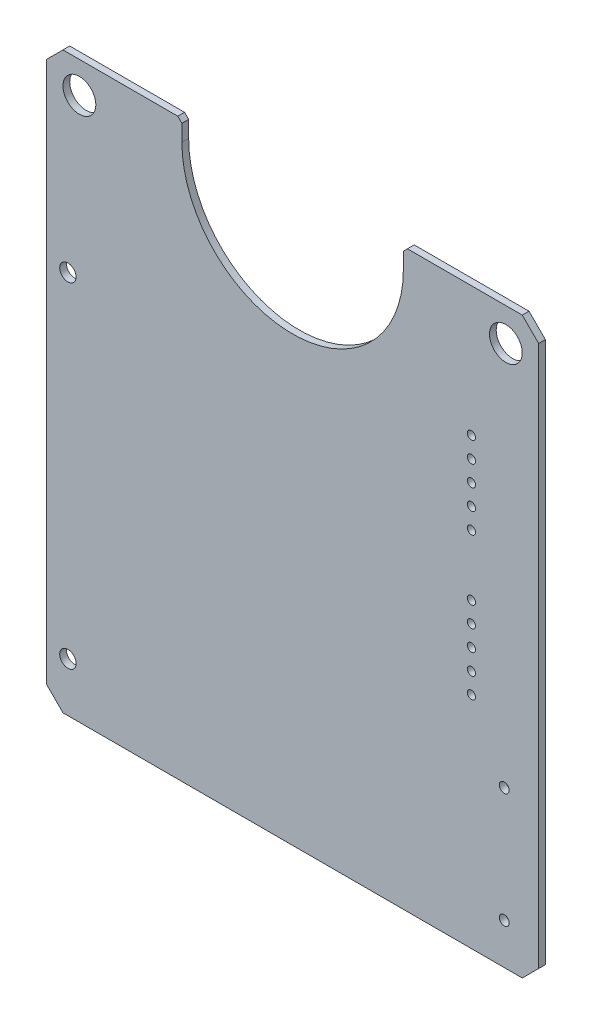
ISO-10303-21;
HEADER;
FILE_DESCRIPTION(('STEP AP214'),'2;1');
FILE_NAME('part.step','',(''),(''),'','','');
FILE_SCHEMA(('AUTOMOTIVE_DESIGN { 1 0 10303 214 1 1 1 1 }'));
ENDSEC;
DATA;
#1=APPLICATION_CONTEXT('core data for automotive mechanical design processes');
#2=APPLICATION_PROTOCOL_DEFINITION('international standard','automotive_design',2000,#1);
#3=PRODUCT_CONTEXT('',#1,'mechanical');
#4=PRODUCT('Part','Part','',(#3));
#5=PRODUCT_RELATED_PRODUCT_CATEGORY('part','',(#4));
#6=PRODUCT_DEFINITION_FORMATION('','',#4);
#7=PRODUCT_DEFINITION_CONTEXT('part definition',#1,'design');
#8=PRODUCT_DEFINITION('design','',#6,#7);
#9=PRODUCT_DEFINITION_SHAPE('','',#8);
#10=(LENGTH_UNIT() NAMED_UNIT(*) SI_UNIT(.MILLI.,.METRE.));
#11=(NAMED_UNIT(*) PLANE_ANGLE_UNIT() SI_UNIT($,.RADIAN.));
#12=(NAMED_UNIT(*) SI_UNIT($,.STERADIAN.) SOLID_ANGLE_UNIT());
#13=UNCERTAINTY_MEASURE_WITH_UNIT(LENGTH_MEASURE(1.E-05),#10,'distance_accuracy_value','');
#14=(GEOMETRIC_REPRESENTATION_CONTEXT(3) GLOBAL_UNCERTAINTY_ASSIGNED_CONTEXT((#13)) GLOBAL_UNIT_ASSIGNED_CONTEXT((#10,
#11,#12)) REPRESENTATION_CONTEXT('',''));
#15=CARTESIAN_POINT('',(0.,0.,0.));
#16=DIRECTION('',(0.,0.,1.));
#17=DIRECTION('',(1.,0.,0.));
#18=AXIS2_PLACEMENT_3D('',#15,#16,#17);
#19=CARTESIAN_POINT('',(86.00000072,100.00000066,0.41148));
#20=DIRECTION('',(0.,0.,1.));
#21=DIRECTION('',(1.,0.,0.));
#22=AXIS2_PLACEMENT_3D('',#19,#20,#21);
#23=PLANE('',#22);
#24=CARTESIAN_POINT('',(112.9999772,132.999988,0.41148));
#25=DIRECTION('',(0.,0.,-1.));
#26=DIRECTION('',(-1.,0.,0.));
#27=AXIS2_PLACEMENT_3D('',#24,#25,#26);
#28=CIRCLE('',#27,1.00000054);
#29=CARTESIAN_POINT('',(111.99997666,132.999988,0.41148));
#30=VERTEX_POINT('',#29);
#31=EDGE_CURVE('E215',#30,#30,#28,.T.);
#32=ORIENTED_EDGE('',*,*,#31,.T.);
#33=EDGE_LOOP('',(#32));
#34=FACE_BOUND('',#33,.T.);
#35=CARTESIAN_POINT('',(110.9000068,118.39999942,0.41148));
#36=DIRECTION('',(0.,0.,-1.));
#37=DIRECTION('',(-1.,0.,0.));
#38=AXIS2_PLACEMENT_3D('',#35,#36,#37);
#39=CIRCLE('',#38,0.2499995);
#40=CARTESIAN_POINT('',(110.6500073,118.39999942,0.41148));
#41=VERTEX_POINT('',#40);
#42=EDGE_CURVE('E313',#41,#41,#39,.T.);
#43=ORIENTED_EDGE('',*,*,#42,.T.);
#44=EDGE_LOOP('',(#43));
#45=FACE_BOUND('',#44,.T.);
#46=CARTESIAN_POINT('',(110.9000068,117.15001462,0.41148));
#47=DIRECTION('',(0.,0.,-1.));
#48=DIRECTION('',(-1.,0.,0.));
#49=AXIS2_PLACEMENT_3D('',#46,#47,#48);
#50=CIRCLE('',#49,0.2499995);
#51=CARTESIAN_POINT('',(110.6500073,117.15001462,0.41148));
#52=VERTEX_POINT('',#51);
#53=EDGE_CURVE('E316',#52,#52,#50,.T.);
#54=ORIENTED_EDGE('',*,*,#53,.T.);
#55=EDGE_LOOP('',(#54));
#56=FACE_BOUND('',#55,.T.);
#57=CARTESIAN_POINT('',(110.9000068,115.89997902,0.41148));
#58=DIRECTION('',(0.,0.,-1.));
#59=DIRECTION('',(-1.,0.,0.));
#60=AXIS2_PLACEMENT_3D('',#57,#58,#59);
#61=CIRCLE('',#60,0.2499995);
#62=CARTESIAN_POINT('',(110.6500073,115.89997902,0.41148));
#63=VERTEX_POINT('',#62);
#64=EDGE_CURVE('E319',#63,#63,#61,.T.);
#65=ORIENTED_EDGE('',*,*,#64,.T.);
#66=EDGE_LOOP('',(#65));
#67=FACE_BOUND('',#66,.T.);
#68=CARTESIAN_POINT('',(112.9000028,109.4999588,0.41148));
#69=DIRECTION('',(0.,0.,-1.));
#70=DIRECTION('',(-1.,0.,0.));
#71=AXIS2_PLACEMENT_3D('',#68,#69,#70);
#72=CIRCLE('',#71,0.2999994);
#73=CARTESIAN_POINT('',(112.6000034,109.4999588,0.41148));
#74=VERTEX_POINT('',#73);
#75=EDGE_CURVE('E322',#74,#74,#72,.T.);
#76=ORIENTED_EDGE('',*,*,#75,.T.);
#77=EDGE_LOOP('',(#76));
#78=FACE_BOUND('',#77,.T.);
#79=CARTESIAN_POINT('',(112.9000028,102.4999728,0.41148));
#80=DIRECTION('',(0.,0.,-1.));
#81=DIRECTION('',(-1.,0.,0.));
#82=AXIS2_PLACEMENT_3D('',#79,#80,#81);
#83=CIRCLE('',#82,0.2999994);
#84=CARTESIAN_POINT('',(112.6000034,102.4999728,0.41148));
#85=VERTEX_POINT('',#84);
#86=EDGE_CURVE('E325',#85,#85,#83,.T.);
#87=ORIENTED_EDGE('',*,*,#86,.T.);
#88=EDGE_LOOP('',(#87));
#89=FACE_BOUND('',#88,.T.);
#90=CARTESIAN_POINT('',(110.9000068,114.64999422,0.41148));
#91=DIRECTION('',(0.,0.,-1.));
#92=DIRECTION('',(-1.,0.,0.));
#93=AXIS2_PLACEMENT_3D('',#90,#91,#92);
#94=CIRCLE('',#93,0.2499995);
#95=CARTESIAN_POINT('',(110.6500073,114.64999422,0.41148));
#96=VERTEX_POINT('',#95);
#97=EDGE_CURVE('E328',#96,#96,#94,.T.);
#98=ORIENTED_EDGE('',*,*,#97,.T.);
#99=EDGE_LOOP('',(#98));
#100=FACE_BOUND('',#99,.T.);
#101=CARTESIAN_POINT('',(110.9000068,113.40000942,0.41148));
#102=DIRECTION('',(0.,0.,-1.));
#103=DIRECTION('',(-1.,0.,0.));
#104=AXIS2_PLACEMENT_3D('',#101,#102,#103);
#105=CIRCLE('',#104,0.2499995);
#106=CARTESIAN_POINT('',(110.6500073,113.40000942,0.41148));
#107=VERTEX_POINT('',#106);
#108=EDGE_CURVE('E331',#107,#107,#105,.T.);
#109=ORIENTED_EDGE('',*,*,#108,.T.);
#110=EDGE_LOOP('',(#109));
#111=FACE_BOUND('',#110,.T.);
#112=CARTESIAN_POINT('',(110.9000068,125.85000738,0.41148));
#113=DIRECTION('',(0.,0.,-1.));
#114=DIRECTION('',(-1.,0.,0.));
#115=AXIS2_PLACEMENT_3D('',#112,#113,#114);
#116=CIRCLE('',#115,0.2499995);
#117=CARTESIAN_POINT('',(110.6500073,125.85000738,0.41148));
#118=VERTEX_POINT('',#117);
#119=EDGE_CURVE('E334',#118,#118,#116,.T.);
#120=ORIENTED_EDGE('',*,*,#119,.T.);
#121=EDGE_LOOP('',(#120));
#122=FACE_BOUND('',#121,.T.);
#123=CARTESIAN_POINT('',(110.9000068,124.60002258,0.41148));
#124=DIRECTION('',(0.,0.,-1.));
#125=DIRECTION('',(-1.,0.,0.));
#126=AXIS2_PLACEMENT_3D('',#123,#124,#125);
#127=CIRCLE('',#126,0.2499995);
#128=CARTESIAN_POINT('',(110.6500073,124.60002258,0.41148));
#129=VERTEX_POINT('',#128);
#130=EDGE_CURVE('E337',#129,#129,#127,.T.);
#131=ORIENTED_EDGE('',*,*,#130,.T.);
#132=EDGE_LOOP('',(#131));
#133=FACE_BOUND('',#132,.T.);
#134=CARTESIAN_POINT('',(86.9999784,133.1000132,0.41148));
#135=DIRECTION('',(0.,0.,-1.));
#136=DIRECTION('',(-1.,0.,0.));
#137=AXIS2_PLACEMENT_3D('',#134,#135,#136);
#138=CIRCLE('',#137,1.00000054);
#139=CARTESIAN_POINT('',(85.99997786,133.1000132,0.41148));
#140=VERTEX_POINT('',#139);
#141=EDGE_CURVE('E340',#140,#140,#138,.T.);
#142=ORIENTED_EDGE('',*,*,#141,.T.);
#143=EDGE_LOOP('',(#142));
#144=FACE_BOUND('',#143,.T.);
#145=CARTESIAN_POINT('',(110.9000068,127.09999218,0.41148));
#146=DIRECTION('',(0.,0.,-1.));
#147=DIRECTION('',(-1.,0.,0.));
#148=AXIS2_PLACEMENT_3D('',#145,#146,#147);
#149=CIRCLE('',#148,0.2499995);
#150=CARTESIAN_POINT('',(110.6500073,127.09999218,0.41148));
#151=VERTEX_POINT('',#150);
#152=EDGE_CURVE('E343',#151,#151,#149,.T.);
#153=ORIENTED_EDGE('',*,*,#152,.T.);
#154=EDGE_LOOP('',(#153));
#155=FACE_BOUND('',#154,.T.);
#156=CARTESIAN_POINT('',(110.9000068,123.35003778,0.41148));
#157=DIRECTION('',(0.,0.,-1.));
#158=DIRECTION('',(-1.,0.,0.));
#159=AXIS2_PLACEMENT_3D('',#156,#157,#158);
#160=CIRCLE('',#159,0.2499995);
#161=CARTESIAN_POINT('',(110.6500073,123.35003778,0.41148));
#162=VERTEX_POINT('',#161);
#163=EDGE_CURVE('E346',#162,#162,#160,.T.);
#164=ORIENTED_EDGE('',*,*,#163,.T.);
#165=EDGE_LOOP('',(#164));
#166=FACE_BOUND('',#165,.T.);
#167=CARTESIAN_POINT('',(110.9000068,122.10000218,0.41148));
#168=DIRECTION('',(0.,0.,-1.));
#169=DIRECTION('',(-1.,0.,0.));
#170=AXIS2_PLACEMENT_3D('',#167,#168,#169);
#171=CIRCLE('',#170,0.2499995);
#172=CARTESIAN_POINT('',(110.6500073,122.10000218,0.41148));
#173=VERTEX_POINT('',#172);
#174=EDGE_CURVE('E349',#173,#173,#171,.T.);
#175=ORIENTED_EDGE('',*,*,#174,.T.);
#176=EDGE_LOOP('',(#175));
#177=FACE_BOUND('',#176,.T.);
#178=CARTESIAN_POINT('',(86.30000774,123.4000072,0.41148));
#179=DIRECTION('',(0.,0.,-1.));
#180=DIRECTION('',(-1.,0.,0.));
#181=AXIS2_PLACEMENT_3D('',#178,#179,#180);
#182=CIRCLE('',#181,0.499999);
#183=CARTESIAN_POINT('',(85.80000874,123.4000072,0.41148));
#184=VERTEX_POINT('',#183);
#185=EDGE_CURVE('E352',#184,#184,#182,.T.);
#186=ORIENTED_EDGE('',*,*,#185,.T.);
#187=EDGE_LOOP('',(#186));
#188=FACE_BOUND('',#187,.T.);
#189=CARTESIAN_POINT('',(86.30000774,102.9999972,0.41148));
#190=DIRECTION('',(0.,0.,-1.));
#191=DIRECTION('',(-1.,0.,0.));
#192=AXIS2_PLACEMENT_3D('',#189,#190,#191);
#193=CIRCLE('',#192,0.499999);
#194=CARTESIAN_POINT('',(85.80000874,102.9999972,0.41148));
#195=VERTEX_POINT('',#194);
#196=EDGE_CURVE('E354',#195,#195,#193,.T.);
#197=ORIENTED_EDGE('',*,*,#196,.T.);
#198=EDGE_LOOP('',(#197));
#199=FACE_BOUND('',#198,.T.);
#200=DIRECTION('',(0.,1.,0.));
#201=VECTOR('',#200,1.);
#202=CARTESIAN_POINT('',(85.00000018,101.0000012,0.41148));
#203=LINE('',#202,#201);
#204=CARTESIAN_POINT('',(85.00000018,101.0000012,0.41148));
#205=VERTEX_POINT('',#204);
#206=CARTESIAN_POINT('',(85.00000018,133.9999987,0.41148));
#207=VERTEX_POINT('',#206);
#208=EDGE_CURVE('E364',#205,#207,#203,.T.);
#209=ORIENTED_EDGE('',*,*,#208,.F.);
#210=DIRECTION('',(0.707106781186548,-0.707106781186548,0.));
#211=VECTOR('',#210,1.);
#212=CARTESIAN_POINT('',(86.00000072,100.00000066,0.41148));
#213=LINE('',#212,#211);
#214=CARTESIAN_POINT('',(86.00000072,100.00000066,0.41148));
#215=VERTEX_POINT('',#214);
#216=EDGE_CURVE('E221',#215,#205,#213,.F.);
#217=ORIENTED_EDGE('',*,*,#216,.F.);
#218=DIRECTION('',(1.,0.,0.));
#219=VECTOR('',#218,1.);
#220=CARTESIAN_POINT('',(114.0000006,100.00000066,0.41148));
#221=LINE('',#220,#219);
#222=CARTESIAN_POINT('',(114.0000006,100.00000066,0.41148));
#223=VERTEX_POINT('',#222);
#224=EDGE_CURVE('E231',#223,#215,#221,.F.);
#225=ORIENTED_EDGE('',*,*,#224,.F.);
#226=DIRECTION('',(0.707106781186548,0.707106781186548,0.));
#227=VECTOR('',#226,1.);
#228=CARTESIAN_POINT('',(115.00000114,101.0000012,0.41148));
#229=LINE('',#228,#227);
#230=CARTESIAN_POINT('',(115.00000114,101.0000012,0.41148));
#231=VERTEX_POINT('',#230);
#232=EDGE_CURVE('E210',#231,#223,#229,.F.);
#233=ORIENTED_EDGE('',*,*,#232,.F.);
#234=DIRECTION('',(0.,1.,0.));
#235=VECTOR('',#234,1.);
#236=CARTESIAN_POINT('',(115.00000114,134.00000124,0.41148));
#237=LINE('',#236,#235);
#238=CARTESIAN_POINT('',(115.00000114,134.00000124,0.41148));
#239=VERTEX_POINT('',#238);
#240=EDGE_CURVE('E200',#239,#231,#237,.F.);
#241=ORIENTED_EDGE('',*,*,#240,.F.);
#242=DIRECTION('',(-0.707106781186548,0.707106781186548,0.));
#243=VECTOR('',#242,1.);
#244=CARTESIAN_POINT('',(114.00000314,134.99999924,0.41148));
#245=LINE('',#244,#243);
#246=CARTESIAN_POINT('',(114.00000314,134.99999924,0.41148));
#247=VERTEX_POINT('',#246);
#248=EDGE_CURVE('E190',#247,#239,#245,.F.);
#249=ORIENTED_EDGE('',*,*,#248,.F.);
#250=DIRECTION('',(1.,0.,0.));
#251=VECTOR('',#250,1.);
#252=CARTESIAN_POINT('',(106.99999936,134.99999924,0.41148));
#253=LINE('',#252,#251);
#254=CARTESIAN_POINT('',(106.99999936,134.99999924,0.41148));
#255=VERTEX_POINT('',#254);
#256=EDGE_CURVE('E180',#255,#247,#253,.T.);
#257=ORIENTED_EDGE('',*,*,#256,.F.);
#258=DIRECTION('',(-0.707106781186548,-0.707106781186548,0.));
#259=VECTOR('',#258,1.);
#260=CARTESIAN_POINT('',(106.7500024,134.75000228,0.41148));
#261=LINE('',#260,#259);
#262=CARTESIAN_POINT('',(106.7500024,134.75000228,0.41148));
#263=VERTEX_POINT('',#262);
#264=EDGE_CURVE('E170',#263,#255,#261,.F.);
#265=ORIENTED_EDGE('',*,*,#264,.F.);
#266=DIRECTION('',(-2.53999862538943E-06,-0.999999999996774,0.));
#267=VECTOR('',#266,1.);
#268=CARTESIAN_POINT('',(106.74999986,133.75000174,0.41148));
#269=LINE('',#268,#267);
#270=CARTESIAN_POINT('',(106.74999986,133.75000174,0.41148));
#271=VERTEX_POINT('',#270);
#272=EDGE_CURVE('E115',#271,#263,#269,.F.);
#273=ORIENTED_EDGE('',*,*,#272,.F.);
#274=CARTESIAN_POINT('',(100.00000447,133.74999792955,0.41148));
#275=DIRECTION('',(0.,0.,-1.));
#276=DIRECTION('',(-1.,0.,0.));
#277=AXIS2_PLACEMENT_3D('',#274,#275,#276);
#278=CIRCLE('',#277,6.749995390001);
#279=CARTESIAN_POINT('',(93.25000908,133.7499992,0.41148));
#280=VERTEX_POINT('',#279);
#281=EDGE_CURVE('E20',#271,#280,#278,.T.);
#282=ORIENTED_EDGE('',*,*,#281,.T.);
#283=DIRECTION('',(2.54001798031643E-06,0.999999999996774,0.));
#284=VECTOR('',#283,1.);
#285=CARTESIAN_POINT('',(93.25001162,134.74999212,0.41148));
#286=LINE('',#285,#284);
#287=CARTESIAN_POINT('',(93.2500116199999,134.74999212,0.41148));
#288=VERTEX_POINT('',#287);
#289=EDGE_CURVE('E121',#288,#280,#286,.F.);
#290=ORIENTED_EDGE('',*,*,#289,.F.);
#291=DIRECTION('',(-0.707113965077055,0.707099597223055,0.));
#292=VECTOR('',#291,1.);
#293=CARTESIAN_POINT('',(92.99999942,134.99999924,0.41148));
#294=LINE('',#293,#292);
#295=CARTESIAN_POINT('',(92.99999942,134.99999924,0.41148));
#296=VERTEX_POINT('',#295);
#297=EDGE_CURVE('E138',#296,#288,#294,.F.);
#298=ORIENTED_EDGE('',*,*,#297,.F.);
#299=DIRECTION('',(1.,0.,0.));
#300=VECTOR('',#299,1.);
#301=CARTESIAN_POINT('',(86.00000072,134.99999924,0.41148));
#302=LINE('',#301,#300);
#303=CARTESIAN_POINT('',(86.00000072,134.99999924,0.41148));
#304=VERTEX_POINT('',#303);
#305=EDGE_CURVE('E153',#304,#296,#302,.T.);
#306=ORIENTED_EDGE('',*,*,#305,.F.);
#307=DIRECTION('',(-0.707106781186548,-0.707106781186548,0.));
#308=VECTOR('',#307,1.);
#309=CARTESIAN_POINT('',(85.00000018,133.9999987,0.41148));
#310=LINE('',#309,#308);
#311=EDGE_CURVE('E143',#207,#304,#310,.F.);
#312=ORIENTED_EDGE('',*,*,#311,.F.);
#313=EDGE_LOOP('',(#209,#217,#225,#233,#241,#249,#257,#265,#273,#282,#290,#298,#306,#312));
#314=FACE_BOUND('',#313,.T.);
#315=ADVANCED_FACE('F17',(#34,#45,#56,#67,#78,#89,#100,#111,#122,#133,#144,#155,#166,#177,#188,
#199,#314),#23,.T.);
#316=CARTESIAN_POINT('',(114.0000006,100.00000066,0.));
#317=DIRECTION('',(0.,-1.,0.));
#318=DIRECTION('',(0.,0.,-1.));
#319=AXIS2_PLACEMENT_3D('',#316,#317,#318);
#320=PLANE('',#319);
#321=DIRECTION('',(0.,0.,1.));
#322=VECTOR('',#321,1.);
#323=CARTESIAN_POINT('',(86.00000072,100.00000066,0.));
#324=LINE('',#323,#322);
#325=CARTESIAN_POINT('',(86.00000072,100.00000066,0.));
#326=VERTEX_POINT('',#325);
#327=EDGE_CURVE('E218',#326,#215,#324,.T.);
#328=ORIENTED_EDGE('',*,*,#327,.F.);
#329=DIRECTION('',(1.,0.,0.));
#330=VECTOR('',#329,1.);
#331=CARTESIAN_POINT('',(86.00000072,100.00000066,0.));
#332=LINE('',#331,#330);
#333=CARTESIAN_POINT('',(114.0000006,100.00000066,0.));
#334=VERTEX_POINT('',#333);
#335=EDGE_CURVE('E205',#326,#334,#332,.T.);
#336=ORIENTED_EDGE('',*,*,#335,.T.);
#337=DIRECTION('',(0.,0.,1.));
#338=VECTOR('',#337,1.);
#339=CARTESIAN_POINT('',(114.0000006,100.00000066,0.));
#340=LINE('',#339,#338);
#341=EDGE_CURVE('E208',#223,#334,#340,.F.);
#342=ORIENTED_EDGE('',*,*,#341,.F.);
#343=ORIENTED_EDGE('',*,*,#224,.T.);
#344=EDGE_LOOP('',(#328,#336,#342,#343));
#345=FACE_BOUND('',#344,.T.);
#346=ADVANCED_FACE('F422',(#345),#320,.T.);
#347=CARTESIAN_POINT('',(115.00000114,101.0000012,0.));
#348=DIRECTION('',(0.707106781186548,-0.707106781186548,0.));
#349=DIRECTION('',(0.707106781186548,0.707106781186548,0.));
#350=AXIS2_PLACEMENT_3D('',#347,#348,#349);
#351=PLANE('',#350);
#352=ORIENTED_EDGE('',*,*,#341,.T.);
#353=DIRECTION('',(0.707106781186543,0.707106781186552,0.));
#354=VECTOR('',#353,1.);
#355=CARTESIAN_POINT('',(114.0000006,100.00000066,0.));
#356=LINE('',#355,#354);
#357=CARTESIAN_POINT('',(115.00000114,101.0000012,0.));
#358=VERTEX_POINT('',#357);
#359=EDGE_CURVE('E195',#334,#358,#356,.T.);
#360=ORIENTED_EDGE('',*,*,#359,.T.);
#361=DIRECTION('',(0.,0.,-1.));
#362=VECTOR('',#361,1.);
#363=CARTESIAN_POINT('',(115.00000114,101.0000012,0.));
#364=LINE('',#363,#362);
#365=EDGE_CURVE('E198',#231,#358,#364,.T.);
#366=ORIENTED_EDGE('',*,*,#365,.F.);
#367=ORIENTED_EDGE('',*,*,#232,.T.);
#368=EDGE_LOOP('',(#352,#360,#366,#367));
#369=FACE_BOUND('',#368,.T.);
#370=ADVANCED_FACE('F417',(#369),#351,.T.);
#371=CARTESIAN_POINT('',(115.00000114,134.00000124,0.));
#372=DIRECTION('',(1.,0.,0.));
#373=DIRECTION('',(0.,0.,-1.));
#374=AXIS2_PLACEMENT_3D('',#371,#372,#373);
#375=PLANE('',#374);
#376=ORIENTED_EDGE('',*,*,#365,.T.);
#377=DIRECTION('',(0.,1.,0.));
#378=VECTOR('',#377,1.);
#379=CARTESIAN_POINT('',(115.00000114,100.00000066,0.));
#380=LINE('',#379,#378);
#381=CARTESIAN_POINT('',(115.00000114,134.00000124,0.));
#382=VERTEX_POINT('',#381);
#383=EDGE_CURVE('E185',#358,#382,#380,.T.);
#384=ORIENTED_EDGE('',*,*,#383,.T.);
#385=DIRECTION('',(0.,0.,1.));
#386=VECTOR('',#385,1.);
#387=CARTESIAN_POINT('',(115.00000114,134.00000124,0.));
#388=LINE('',#387,#386);
#389=EDGE_CURVE('E188',#239,#382,#388,.F.);
#390=ORIENTED_EDGE('',*,*,#389,.F.);
#391=ORIENTED_EDGE('',*,*,#240,.T.);
#392=EDGE_LOOP('',(#376,#384,#390,#391));
#393=FACE_BOUND('',#392,.T.);
#394=ADVANCED_FACE('F412',(#393),#375,.T.);
#395=CARTESIAN_POINT('',(114.00000314,134.99999924,0.));
#396=DIRECTION('',(0.707106781186548,0.707106781186548,0.));
#397=DIRECTION('',(-0.707106781186548,0.707106781186548,0.));
#398=AXIS2_PLACEMENT_3D('',#395,#396,#397);
#399=PLANE('',#398);
#400=ORIENTED_EDGE('',*,*,#389,.T.);
#401=DIRECTION('',(-0.707106781186547,0.707106781186547,0.));
#402=VECTOR('',#401,1.);
#403=CARTESIAN_POINT('',(115.00000114,134.00000124,0.));
#404=LINE('',#403,#402);
#405=CARTESIAN_POINT('',(114.00000314,134.99999924,0.));
#406=VERTEX_POINT('',#405);
#407=EDGE_CURVE('E175',#382,#406,#404,.T.);
#408=ORIENTED_EDGE('',*,*,#407,.T.);
#409=DIRECTION('',(0.,0.,1.));
#410=VECTOR('',#409,1.);
#411=CARTESIAN_POINT('',(114.00000314,134.99999924,0.));
#412=LINE('',#411,#410);
#413=EDGE_CURVE('E178',#247,#406,#412,.F.);
#414=ORIENTED_EDGE('',*,*,#413,.F.);
#415=ORIENTED_EDGE('',*,*,#248,.T.);
#416=EDGE_LOOP('',(#400,#408,#414,#415));
#417=FACE_BOUND('',#416,.T.);
#418=ADVANCED_FACE('F408',(#417),#399,.T.);
#419=CARTESIAN_POINT('',(106.99999936,134.99999924,0.));
#420=DIRECTION('',(0.,1.,0.));
#421=DIRECTION('',(0.,0.,1.));
#422=AXIS2_PLACEMENT_3D('',#419,#420,#421);
#423=PLANE('',#422);
#424=ORIENTED_EDGE('',*,*,#413,.T.);
#425=DIRECTION('',(1.,0.,0.));
#426=VECTOR('',#425,1.);
#427=CARTESIAN_POINT('',(86.00000072,134.99999924,0.));
#428=LINE('',#427,#426);
#429=CARTESIAN_POINT('',(106.99999936,134.99999924,0.));
#430=VERTEX_POINT('',#429);
#431=EDGE_CURVE('E165',#406,#430,#428,.F.);
#432=ORIENTED_EDGE('',*,*,#431,.T.);
#433=DIRECTION('',(0.,0.,1.));
#434=VECTOR('',#433,1.);
#435=CARTESIAN_POINT('',(106.99999936,134.99999924,0.));
#436=LINE('',#435,#434);
#437=EDGE_CURVE('E168',#255,#430,#436,.F.);
#438=ORIENTED_EDGE('',*,*,#437,.F.);
#439=ORIENTED_EDGE('',*,*,#256,.T.);
#440=EDGE_LOOP('',(#424,#432,#438,#439));
#441=FACE_BOUND('',#440,.T.);
#442=ADVANCED_FACE('F402',(#441),#423,.T.);
#443=CARTESIAN_POINT('',(106.7500024,134.75000228,0.));
#444=DIRECTION('',(-0.707106781186548,0.707106781186548,0.));
#445=DIRECTION('',(-0.707106781186548,-0.707106781186548,0.));
#446=AXIS2_PLACEMENT_3D('',#443,#444,#445);
#447=PLANE('',#446);
#448=ORIENTED_EDGE('',*,*,#437,.T.);
#449=DIRECTION('',(-0.707106781186548,-0.707106781186548,0.));
#450=VECTOR('',#449,1.);
#451=CARTESIAN_POINT('',(106.99999936,134.99999924,0.));
#452=LINE('',#451,#450);
#453=CARTESIAN_POINT('',(106.7500024,134.75000228,0.));
#454=VERTEX_POINT('',#453);
#455=EDGE_CURVE('E161',#430,#454,#452,.T.);
#456=ORIENTED_EDGE('',*,*,#455,.T.);
#457=DIRECTION('',(0.,0.,1.));
#458=VECTOR('',#457,1.);
#459=CARTESIAN_POINT('',(106.7500024,134.75000228,0.));
#460=LINE('',#459,#458);
#461=EDGE_CURVE('E157',#263,#454,#460,.F.);
#462=ORIENTED_EDGE('',*,*,#461,.F.);
#463=ORIENTED_EDGE('',*,*,#264,.T.);
#464=EDGE_LOOP('',(#448,#456,#462,#463));
#465=FACE_BOUND('',#464,.T.);
#466=ADVANCED_FACE('F398',(#465),#447,.T.);
#467=CARTESIAN_POINT('',(106.74999986,133.75000174,0.));
#468=DIRECTION('',(-0.999999999996774,2.53999862538943E-06,0.));
#469=DIRECTION('',(-2.53999862538943E-06,-0.999999999996774,0.));
#470=AXIS2_PLACEMENT_3D('',#467,#468,#469);
#471=PLANE('',#470);
#472=ORIENTED_EDGE('',*,*,#461,.T.);
#473=DIRECTION('',(0.,1.,0.));
#474=VECTOR('',#473,1.);
#475=CARTESIAN_POINT('',(106.7500024,100.00000066,0.));
#476=LINE('',#475,#474);
#477=CARTESIAN_POINT('',(106.75000113,133.749999834775,0.));
#478=VERTEX_POINT('',#477);
#479=EDGE_CURVE('E164',#454,#478,#476,.F.);
#480=ORIENTED_EDGE('',*,*,#479,.T.);
#481=DIRECTION('',(0.,0.,-1.));
#482=VECTOR('',#481,1.);
#483=CARTESIAN_POINT('',(106.74999986,133.75000174,0.));
#484=LINE('',#483,#482);
#485=EDGE_CURVE('E133',#478,#271,#484,.F.);
#486=ORIENTED_EDGE('',*,*,#485,.T.);
#487=ORIENTED_EDGE('',*,*,#272,.T.);
#488=EDGE_LOOP('',(#472,#480,#486,#487));
#489=FACE_BOUND('',#488,.T.);
#490=ADVANCED_FACE('F391',(#489),#471,.T.);
#491=CARTESIAN_POINT('',(100.00000447,133.74999792955,0.));
#492=DIRECTION('',(0.,0.,-1.));
#493=DIRECTION('',(-1.,0.,0.));
#494=AXIS2_PLACEMENT_3D('',#491,#492,#493);
#495=CYLINDRICAL_SURFACE('',#494,6.749995390001);
#496=ORIENTED_EDGE('',*,*,#281,.F.);
#497=ORIENTED_EDGE('',*,*,#485,.F.);
#498=CARTESIAN_POINT('',(100.00000447,133.74999792955,0.));
#499=DIRECTION('',(0.,0.,-1.));
#500=DIRECTION('',(-1.,0.,0.));
#501=AXIS2_PLACEMENT_3D('',#498,#499,#500);
#502=CIRCLE('',#501,6.749995390001);
#503=CARTESIAN_POINT('',(93.25000908,133.749998564775,0.));
#504=VERTEX_POINT('',#503);
#505=EDGE_CURVE('E137',#478,#504,#502,.T.);
#506=ORIENTED_EDGE('',*,*,#505,.T.);
#507=DIRECTION('',(0.,0.,1.));
#508=VECTOR('',#507,1.);
#509=CARTESIAN_POINT('',(93.25000908,133.7499992,0.));
#510=LINE('',#509,#508);
#511=EDGE_CURVE('E125',#280,#504,#510,.F.);
#512=ORIENTED_EDGE('',*,*,#511,.F.);
#513=EDGE_LOOP('',(#496,#497,#506,#512));
#514=FACE_BOUND('',#513,.T.);
#515=ADVANCED_FACE('F135',(#514),#495,.F.);
#516=CARTESIAN_POINT('',(93.25001162,134.74999212,0.));
#517=DIRECTION('',(0.999999999996774,-2.54001798031643E-06,0.));
#518=DIRECTION('',(2.54001798031643E-06,0.999999999996774,0.));
#519=AXIS2_PLACEMENT_3D('',#516,#517,#518);
#520=PLANE('',#519);
#521=ORIENTED_EDGE('',*,*,#511,.T.);
#522=DIRECTION('',(0.,1.,0.));
#523=VECTOR('',#522,1.);
#524=CARTESIAN_POINT('',(93.25000908,100.00000066,0.));
#525=LINE('',#524,#523);
#526=CARTESIAN_POINT('',(93.2500099266666,134.749993813299,0.));
#527=VERTEX_POINT('',#526);
#528=EDGE_CURVE('E149',#504,#527,#525,.T.);
#529=ORIENTED_EDGE('',*,*,#528,.T.);
#530=DIRECTION('',(0.,0.,1.));
#531=VECTOR('',#530,1.);
#532=CARTESIAN_POINT('',(93.2500116199999,134.74999212,0.));
#533=LINE('',#532,#531);
#534=EDGE_CURVE('E127',#288,#527,#533,.F.);
#535=ORIENTED_EDGE('',*,*,#534,.F.);
#536=ORIENTED_EDGE('',*,*,#289,.T.);
#537=EDGE_LOOP('',(#521,#529,#535,#536));
#538=FACE_BOUND('',#537,.T.);
#539=ADVANCED_FACE('F122',(#538),#520,.T.);
#540=CARTESIAN_POINT('',(92.99999942,134.99999924,0.));
#541=DIRECTION('',(0.707099597223055,0.707113965077055,0.));
#542=DIRECTION('',(-0.707113965077055,0.707099597223055,0.));
#543=AXIS2_PLACEMENT_3D('',#540,#541,#542);
#544=PLANE('',#543);
#545=ORIENTED_EDGE('',*,*,#534,.T.);
#546=DIRECTION('',(-0.70711396507737,0.707099597222739,0.));
#547=VECTOR('',#546,1.);
#548=CARTESIAN_POINT('',(93.25001162,134.74999212,0.));
#549=LINE('',#548,#547);
#550=CARTESIAN_POINT('',(92.99999942,134.99999924,0.));
#551=VERTEX_POINT('',#550);
#552=EDGE_CURVE('E145',#527,#551,#549,.T.);
#553=ORIENTED_EDGE('',*,*,#552,.T.);
#554=DIRECTION('',(0.,0.,1.));
#555=VECTOR('',#554,1.);
#556=CARTESIAN_POINT('',(92.99999942,134.99999924,0.));
#557=LINE('',#556,#555);
#558=EDGE_CURVE('E243',#296,#551,#557,.F.);
#559=ORIENTED_EDGE('',*,*,#558,.F.);
#560=ORIENTED_EDGE('',*,*,#297,.T.);
#561=EDGE_LOOP('',(#545,#553,#559,#560));
#562=FACE_BOUND('',#561,.T.);
#563=ADVANCED_FACE('F606',(#562),#544,.T.);
#564=CARTESIAN_POINT('',(86.00000072,134.99999924,0.));
#565=DIRECTION('',(0.,1.,0.));
#566=DIRECTION('',(0.,0.,1.));
#567=AXIS2_PLACEMENT_3D('',#564,#565,#566);
#568=PLANE('',#567);
#569=ORIENTED_EDGE('',*,*,#558,.T.);
#570=DIRECTION('',(1.,0.,0.));
#571=VECTOR('',#570,1.);
#572=CARTESIAN_POINT('',(86.00000072,134.99999924,0.));
#573=LINE('',#572,#571);
#574=CARTESIAN_POINT('',(86.00000072,134.99999924,0.));
#575=VERTEX_POINT('',#574);
#576=EDGE_CURVE('E148',#551,#575,#573,.F.);
#577=ORIENTED_EDGE('',*,*,#576,.T.);
#578=DIRECTION('',(0.,0.,1.));
#579=VECTOR('',#578,1.);
#580=CARTESIAN_POINT('',(86.00000072,134.99999924,0.));
#581=LINE('',#580,#579);
#582=EDGE_CURVE('E365',#304,#575,#581,.F.);
#583=ORIENTED_EDGE('',*,*,#582,.F.);
#584=ORIENTED_EDGE('',*,*,#305,.T.);
#585=EDGE_LOOP('',(#569,#577,#583,#584));
#586=FACE_BOUND('',#585,.T.);
#587=ADVANCED_FACE('F377',(#586),#568,.T.);
#588=CARTESIAN_POINT('',(85.00000018,133.9999987,0.));
#589=DIRECTION('',(-0.707106781186548,0.707106781186548,0.));
#590=DIRECTION('',(-0.707106781186548,-0.707106781186548,0.));
#591=AXIS2_PLACEMENT_3D('',#588,#589,#590);
#592=PLANE('',#591);
#593=ORIENTED_EDGE('',*,*,#582,.T.);
#594=DIRECTION('',(-0.707106781186543,-0.707106781186552,0.));
#595=VECTOR('',#594,1.);
#596=CARTESIAN_POINT('',(86.00000072,134.99999924,0.));
#597=LINE('',#596,#595);
#598=CARTESIAN_POINT('',(85.00000018,133.9999987,0.));
#599=VERTEX_POINT('',#598);
#600=EDGE_CURVE('E381',#575,#599,#597,.T.);
#601=ORIENTED_EDGE('',*,*,#600,.T.);
#602=DIRECTION('',(0.,0.,1.));
#603=VECTOR('',#602,1.);
#604=CARTESIAN_POINT('',(85.00000018,133.9999987,0.));
#605=LINE('',#604,#603);
#606=EDGE_CURVE('E222',#207,#599,#605,.F.);
#607=ORIENTED_EDGE('',*,*,#606,.F.);
#608=ORIENTED_EDGE('',*,*,#311,.T.);
#609=EDGE_LOOP('',(#593,#601,#607,#608));
#610=FACE_BOUND('',#609,.T.);
#611=ADVANCED_FACE('F373',(#610),#592,.T.);
#612=CARTESIAN_POINT('',(85.00000018,101.0000012,0.));
#613=DIRECTION('',(-1.,0.,0.));
#614=DIRECTION('',(0.,0.,1.));
#615=AXIS2_PLACEMENT_3D('',#612,#613,#614);
#616=PLANE('',#615);
#617=ORIENTED_EDGE('',*,*,#606,.T.);
#618=DIRECTION('',(0.,1.,0.));
#619=VECTOR('',#618,1.);
#620=CARTESIAN_POINT('',(85.00000018,100.00000066,0.));
#621=LINE('',#620,#619);
#622=CARTESIAN_POINT('',(85.00000018,101.0000012,0.));
#623=VERTEX_POINT('',#622);
#624=EDGE_CURVE('E228',#599,#623,#621,.F.);
#625=ORIENTED_EDGE('',*,*,#624,.T.);
#626=DIRECTION('',(0.,0.,1.));
#627=VECTOR('',#626,1.);
#628=CARTESIAN_POINT('',(85.00000018,101.0000012,0.));
#629=LINE('',#628,#627);
#630=EDGE_CURVE('E35',#205,#623,#629,.F.);
#631=ORIENTED_EDGE('',*,*,#630,.F.);
#632=ORIENTED_EDGE('',*,*,#208,.T.);
#633=EDGE_LOOP('',(#617,#625,#631,#632));
#634=FACE_BOUND('',#633,.T.);
#635=ADVANCED_FACE('F425',(#634),#616,.T.);
#636=CARTESIAN_POINT('',(86.00000072,100.00000066,0.));
#637=DIRECTION('',(-0.707106781186548,-0.707106781186548,0.));
#638=DIRECTION('',(0.707106781186548,-0.707106781186548,0.));
#639=AXIS2_PLACEMENT_3D('',#636,#637,#638);
#640=PLANE('',#639);
#641=ORIENTED_EDGE('',*,*,#630,.T.);
#642=DIRECTION('',(0.707106781186548,-0.707106781186548,0.));
#643=VECTOR('',#642,1.);
#644=CARTESIAN_POINT('',(85.00000018,101.0000012,0.));
#645=LINE('',#644,#643);
#646=EDGE_CURVE('E225',#623,#326,#645,.T.);
#647=ORIENTED_EDGE('',*,*,#646,.T.);
#648=ORIENTED_EDGE('',*,*,#327,.T.);
#649=ORIENTED_EDGE('',*,*,#216,.T.);
#650=EDGE_LOOP('',(#641,#647,#648,#649));
#651=FACE_BOUND('',#650,.T.);
#652=ADVANCED_FACE('F427',(#651),#640,.T.);
#653=CARTESIAN_POINT('',(86.30000774,102.9999972,0.));
#654=DIRECTION('',(0.,0.,-1.));
#655=DIRECTION('',(-1.,0.,0.));
#656=AXIS2_PLACEMENT_3D('',#653,#654,#655);
#657=CYLINDRICAL_SURFACE('',#656,0.499999);
#658=ORIENTED_EDGE('',*,*,#196,.F.);
#659=EDGE_LOOP('',(#658));
#660=FACE_BOUND('',#659,.T.);
#661=CARTESIAN_POINT('',(86.30000774,102.9999972,0.));
#662=DIRECTION('',(0.,0.,-1.));
#663=DIRECTION('',(-1.,0.,0.));
#664=AXIS2_PLACEMENT_3D('',#661,#662,#663);
#665=CIRCLE('',#664,0.499999);
#666=CARTESIAN_POINT('',(85.80000874,102.9999972,0.));
#667=VERTEX_POINT('',#666);
#668=EDGE_CURVE('E227',#667,#667,#665,.T.);
#669=ORIENTED_EDGE('',*,*,#668,.T.);
#670=EDGE_LOOP('',(#669));
#671=FACE_BOUND('',#670,.T.);
#672=ADVANCED_FACE('F429',(#660,#671),#657,.F.);
#673=CARTESIAN_POINT('',(86.30000774,123.4000072,0.));
#674=DIRECTION('',(0.,0.,-1.));
#675=DIRECTION('',(-1.,0.,0.));
#676=AXIS2_PLACEMENT_3D('',#673,#674,#675);
#677=CYLINDRICAL_SURFACE('',#676,0.499999);
#678=ORIENTED_EDGE('',*,*,#185,.F.);
#679=EDGE_LOOP('',(#678));
#680=FACE_BOUND('',#679,.T.);
#681=CARTESIAN_POINT('',(86.30000774,123.4000072,0.));
#682=DIRECTION('',(0.,0.,-1.));
#683=DIRECTION('',(-1.,0.,0.));
#684=AXIS2_PLACEMENT_3D('',#681,#682,#683);
#685=CIRCLE('',#684,0.499999);
#686=CARTESIAN_POINT('',(85.80000874,123.4000072,0.));
#687=VERTEX_POINT('',#686);
#688=EDGE_CURVE('E305',#687,#687,#685,.T.);
#689=ORIENTED_EDGE('',*,*,#688,.T.);
#690=EDGE_LOOP('',(#689));
#691=FACE_BOUND('',#690,.T.);
#692=ADVANCED_FACE('F436',(#680,#691),#677,.F.);
#693=CARTESIAN_POINT('',(110.9000068,122.10000218,0.));
#694=DIRECTION('',(0.,0.,-1.));
#695=DIRECTION('',(-1.,0.,0.));
#696=AXIS2_PLACEMENT_3D('',#693,#694,#695);
#697=CYLINDRICAL_SURFACE('',#696,0.2499995);
#698=ORIENTED_EDGE('',*,*,#174,.F.);
#699=EDGE_LOOP('',(#698));
#700=FACE_BOUND('',#699,.T.);
#701=CARTESIAN_POINT('',(110.9000068,122.10000218,0.));
#702=DIRECTION('',(0.,0.,-1.));
#703=DIRECTION('',(-1.,0.,0.));
#704=AXIS2_PLACEMENT_3D('',#701,#702,#703);
#705=CIRCLE('',#704,0.2499995);
#706=CARTESIAN_POINT('',(110.6500073,122.10000218,0.));
#707=VERTEX_POINT('',#706);
#708=EDGE_CURVE('E302',#707,#707,#705,.T.);
#709=ORIENTED_EDGE('',*,*,#708,.T.);
#710=EDGE_LOOP('',(#709));
#711=FACE_BOUND('',#710,.T.);
#712=ADVANCED_FACE('F499',(#700,#711),#697,.F.);
#713=CARTESIAN_POINT('',(110.9000068,123.35003778,0.));
#714=DIRECTION('',(0.,0.,-1.));
#715=DIRECTION('',(-1.,0.,0.));
#716=AXIS2_PLACEMENT_3D('',#713,#714,#715);
#717=CYLINDRICAL_SURFACE('',#716,0.2499995);
#718=ORIENTED_EDGE('',*,*,#163,.F.);
#719=EDGE_LOOP('',(#718));
#720=FACE_BOUND('',#719,.T.);
#721=CARTESIAN_POINT('',(110.9000068,123.35003778,0.));
#722=DIRECTION('',(0.,0.,-1.));
#723=DIRECTION('',(-1.,0.,0.));
#724=AXIS2_PLACEMENT_3D('',#721,#722,#723);
#725=CIRCLE('',#724,0.2499995);
#726=CARTESIAN_POINT('',(110.6500073,123.35003778,0.));
#727=VERTEX_POINT('',#726);
#728=EDGE_CURVE('E299',#727,#727,#725,.T.);
#729=ORIENTED_EDGE('',*,*,#728,.T.);
#730=EDGE_LOOP('',(#729));
#731=FACE_BOUND('',#730,.T.);
#732=ADVANCED_FACE('F495',(#720,#731),#717,.F.);
#733=CARTESIAN_POINT('',(110.9000068,127.09999218,0.));
#734=DIRECTION('',(0.,0.,-1.));
#735=DIRECTION('',(-1.,0.,0.));
#736=AXIS2_PLACEMENT_3D('',#733,#734,#735);
#737=CYLINDRICAL_SURFACE('',#736,0.2499995);
#738=ORIENTED_EDGE('',*,*,#152,.F.);
#739=EDGE_LOOP('',(#738));
#740=FACE_BOUND('',#739,.T.);
#741=CARTESIAN_POINT('',(110.9000068,127.09999218,0.));
#742=DIRECTION('',(0.,0.,-1.));
#743=DIRECTION('',(-1.,0.,0.));
#744=AXIS2_PLACEMENT_3D('',#741,#742,#743);
#745=CIRCLE('',#744,0.2499995);
#746=CARTESIAN_POINT('',(110.6500073,127.09999218,0.));
#747=VERTEX_POINT('',#746);
#748=EDGE_CURVE('E296',#747,#747,#745,.T.);
#749=ORIENTED_EDGE('',*,*,#748,.T.);
#750=EDGE_LOOP('',(#749));
#751=FACE_BOUND('',#750,.T.);
#752=ADVANCED_FACE('F491',(#740,#751),#737,.F.);
#753=CARTESIAN_POINT('',(86.9999784,133.1000132,0.));
#754=DIRECTION('',(0.,0.,-1.));
#755=DIRECTION('',(-1.,0.,0.));
#756=AXIS2_PLACEMENT_3D('',#753,#754,#755);
#757=CYLINDRICAL_SURFACE('',#756,1.00000054);
#758=ORIENTED_EDGE('',*,*,#141,.F.);
#759=EDGE_LOOP('',(#758));
#760=FACE_BOUND('',#759,.T.);
#761=CARTESIAN_POINT('',(86.9999784,133.1000132,0.));
#762=DIRECTION('',(0.,0.,-1.));
#763=DIRECTION('',(-1.,0.,0.));
#764=AXIS2_PLACEMENT_3D('',#761,#762,#763);
#765=CIRCLE('',#764,1.00000054);
#766=CARTESIAN_POINT('',(85.99997786,133.1000132,0.));
#767=VERTEX_POINT('',#766);
#768=EDGE_CURVE('E293',#767,#767,#765,.T.);
#769=ORIENTED_EDGE('',*,*,#768,.T.);
#770=EDGE_LOOP('',(#769));
#771=FACE_BOUND('',#770,.T.);
#772=ADVANCED_FACE('F487',(#760,#771),#757,.F.);
#773=CARTESIAN_POINT('',(110.9000068,124.60002258,0.));
#774=DIRECTION('',(0.,0.,-1.));
#775=DIRECTION('',(-1.,0.,0.));
#776=AXIS2_PLACEMENT_3D('',#773,#774,#775);
#777=CYLINDRICAL_SURFACE('',#776,0.2499995);
#778=ORIENTED_EDGE('',*,*,#130,.F.);
#779=EDGE_LOOP('',(#778));
#780=FACE_BOUND('',#779,.T.);
#781=CARTESIAN_POINT('',(110.9000068,124.60002258,0.));
#782=DIRECTION('',(0.,0.,-1.));
#783=DIRECTION('',(-1.,0.,0.));
#784=AXIS2_PLACEMENT_3D('',#781,#782,#783);
#785=CIRCLE('',#784,0.2499995);
#786=CARTESIAN_POINT('',(110.6500073,124.60002258,0.));
#787=VERTEX_POINT('',#786);
#788=EDGE_CURVE('E290',#787,#787,#785,.T.);
#789=ORIENTED_EDGE('',*,*,#788,.T.);
#790=EDGE_LOOP('',(#789));
#791=FACE_BOUND('',#790,.T.);
#792=ADVANCED_FACE('F483',(#780,#791),#777,.F.);
#793=CARTESIAN_POINT('',(110.9000068,125.85000738,0.));
#794=DIRECTION('',(0.,0.,-1.));
#795=DIRECTION('',(-1.,0.,0.));
#796=AXIS2_PLACEMENT_3D('',#793,#794,#795);
#797=CYLINDRICAL_SURFACE('',#796,0.2499995);
#798=ORIENTED_EDGE('',*,*,#119,.F.);
#799=EDGE_LOOP('',(#798));
#800=FACE_BOUND('',#799,.T.);
#801=CARTESIAN_POINT('',(110.9000068,125.85000738,0.));
#802=DIRECTION('',(0.,0.,-1.));
#803=DIRECTION('',(-1.,0.,0.));
#804=AXIS2_PLACEMENT_3D('',#801,#802,#803);
#805=CIRCLE('',#804,0.2499995);
#806=CARTESIAN_POINT('',(110.6500073,125.85000738,0.));
#807=VERTEX_POINT('',#806);
#808=EDGE_CURVE('E287',#807,#807,#805,.T.);
#809=ORIENTED_EDGE('',*,*,#808,.T.);
#810=EDGE_LOOP('',(#809));
#811=FACE_BOUND('',#810,.T.);
#812=ADVANCED_FACE('F479',(#800,#811),#797,.F.);
#813=CARTESIAN_POINT('',(110.9000068,113.40000942,0.));
#814=DIRECTION('',(0.,0.,-1.));
#815=DIRECTION('',(-1.,0.,0.));
#816=AXIS2_PLACEMENT_3D('',#813,#814,#815);
#817=CYLINDRICAL_SURFACE('',#816,0.2499995);
#818=ORIENTED_EDGE('',*,*,#108,.F.);
#819=EDGE_LOOP('',(#818));
#820=FACE_BOUND('',#819,.T.);
#821=CARTESIAN_POINT('',(110.9000068,113.40000942,0.));
#822=DIRECTION('',(0.,0.,-1.));
#823=DIRECTION('',(-1.,0.,0.));
#824=AXIS2_PLACEMENT_3D('',#821,#822,#823);
#825=CIRCLE('',#824,0.2499995);
#826=CARTESIAN_POINT('',(110.6500073,113.40000942,0.));
#827=VERTEX_POINT('',#826);
#828=EDGE_CURVE('E284',#827,#827,#825,.T.);
#829=ORIENTED_EDGE('',*,*,#828,.T.);
#830=EDGE_LOOP('',(#829));
#831=FACE_BOUND('',#830,.T.);
#832=ADVANCED_FACE('F475',(#820,#831),#817,.F.);
#833=CARTESIAN_POINT('',(110.9000068,114.64999422,0.));
#834=DIRECTION('',(0.,0.,-1.));
#835=DIRECTION('',(-1.,0.,0.));
#836=AXIS2_PLACEMENT_3D('',#833,#834,#835);
#837=CYLINDRICAL_SURFACE('',#836,0.2499995);
#838=ORIENTED_EDGE('',*,*,#97,.F.);
#839=EDGE_LOOP('',(#838));
#840=FACE_BOUND('',#839,.T.);
#841=CARTESIAN_POINT('',(110.9000068,114.64999422,0.));
#842=DIRECTION('',(0.,0.,-1.));
#843=DIRECTION('',(-1.,0.,0.));
#844=AXIS2_PLACEMENT_3D('',#841,#842,#843);
#845=CIRCLE('',#844,0.2499995);
#846=CARTESIAN_POINT('',(110.6500073,114.64999422,0.));
#847=VERTEX_POINT('',#846);
#848=EDGE_CURVE('E281',#847,#847,#845,.T.);
#849=ORIENTED_EDGE('',*,*,#848,.T.);
#850=EDGE_LOOP('',(#849));
#851=FACE_BOUND('',#850,.T.);
#852=ADVANCED_FACE('F471',(#840,#851),#837,.F.);
#853=CARTESIAN_POINT('',(112.9000028,102.4999728,0.));
#854=DIRECTION('',(0.,0.,-1.));
#855=DIRECTION('',(-1.,0.,0.));
#856=AXIS2_PLACEMENT_3D('',#853,#854,#855);
#857=CYLINDRICAL_SURFACE('',#856,0.2999994);
#858=ORIENTED_EDGE('',*,*,#86,.F.);
#859=EDGE_LOOP('',(#858));
#860=FACE_BOUND('',#859,.T.);
#861=CARTESIAN_POINT('',(112.9000028,102.4999728,0.));
#862=DIRECTION('',(0.,0.,-1.));
#863=DIRECTION('',(-1.,0.,0.));
#864=AXIS2_PLACEMENT_3D('',#861,#862,#863);
#865=CIRCLE('',#864,0.2999994);
#866=CARTESIAN_POINT('',(112.6000034,102.4999728,0.));
#867=VERTEX_POINT('',#866);
#868=EDGE_CURVE('E278',#867,#867,#865,.T.);
#869=ORIENTED_EDGE('',*,*,#868,.T.);
#870=EDGE_LOOP('',(#869));
#871=FACE_BOUND('',#870,.T.);
#872=ADVANCED_FACE('F467',(#860,#871),#857,.F.);
#873=CARTESIAN_POINT('',(112.9000028,109.4999588,0.));
#874=DIRECTION('',(0.,0.,-1.));
#875=DIRECTION('',(-1.,0.,0.));
#876=AXIS2_PLACEMENT_3D('',#873,#874,#875);
#877=CYLINDRICAL_SURFACE('',#876,0.2999994);
#878=ORIENTED_EDGE('',*,*,#75,.F.);
#879=EDGE_LOOP('',(#878));
#880=FACE_BOUND('',#879,.T.);
#881=CARTESIAN_POINT('',(112.9000028,109.4999588,0.));
#882=DIRECTION('',(0.,0.,-1.));
#883=DIRECTION('',(-1.,0.,0.));
#884=AXIS2_PLACEMENT_3D('',#881,#882,#883);
#885=CIRCLE('',#884,0.2999994);
#886=CARTESIAN_POINT('',(112.6000034,109.4999588,0.));
#887=VERTEX_POINT('',#886);
#888=EDGE_CURVE('E275',#887,#887,#885,.T.);
#889=ORIENTED_EDGE('',*,*,#888,.T.);
#890=EDGE_LOOP('',(#889));
#891=FACE_BOUND('',#890,.T.);
#892=ADVANCED_FACE('F463',(#880,#891),#877,.F.);
#893=CARTESIAN_POINT('',(110.9000068,115.89997902,0.));
#894=DIRECTION('',(0.,0.,-1.));
#895=DIRECTION('',(-1.,0.,0.));
#896=AXIS2_PLACEMENT_3D('',#893,#894,#895);
#897=CYLINDRICAL_SURFACE('',#896,0.2499995);
#898=ORIENTED_EDGE('',*,*,#64,.F.);
#899=EDGE_LOOP('',(#898));
#900=FACE_BOUND('',#899,.T.);
#901=CARTESIAN_POINT('',(110.9000068,115.89997902,0.));
#902=DIRECTION('',(0.,0.,-1.));
#903=DIRECTION('',(-1.,0.,0.));
#904=AXIS2_PLACEMENT_3D('',#901,#902,#903);
#905=CIRCLE('',#904,0.2499995);
#906=CARTESIAN_POINT('',(110.6500073,115.89997902,0.));
#907=VERTEX_POINT('',#906);
#908=EDGE_CURVE('E272',#907,#907,#905,.T.);
#909=ORIENTED_EDGE('',*,*,#908,.T.);
#910=EDGE_LOOP('',(#909));
#911=FACE_BOUND('',#910,.T.);
#912=ADVANCED_FACE('F459',(#900,#911),#897,.F.);
#913=CARTESIAN_POINT('',(110.9000068,117.15001462,0.));
#914=DIRECTION('',(0.,0.,-1.));
#915=DIRECTION('',(-1.,0.,0.));
#916=AXIS2_PLACEMENT_3D('',#913,#914,#915);
#917=CYLINDRICAL_SURFACE('',#916,0.2499995);
#918=ORIENTED_EDGE('',*,*,#53,.F.);
#919=EDGE_LOOP('',(#918));
#920=FACE_BOUND('',#919,.T.);
#921=CARTESIAN_POINT('',(110.9000068,117.15001462,0.));
#922=DIRECTION('',(0.,0.,-1.));
#923=DIRECTION('',(-1.,0.,0.));
#924=AXIS2_PLACEMENT_3D('',#921,#922,#923);
#925=CIRCLE('',#924,0.2499995);
#926=CARTESIAN_POINT('',(110.6500073,117.15001462,0.));
#927=VERTEX_POINT('',#926);
#928=EDGE_CURVE('E269',#927,#927,#925,.T.);
#929=ORIENTED_EDGE('',*,*,#928,.T.);
#930=EDGE_LOOP('',(#929));
#931=FACE_BOUND('',#930,.T.);
#932=ADVANCED_FACE('F455',(#920,#931),#917,.F.);
#933=CARTESIAN_POINT('',(110.9000068,118.39999942,0.));
#934=DIRECTION('',(0.,0.,-1.));
#935=DIRECTION('',(-1.,0.,0.));
#936=AXIS2_PLACEMENT_3D('',#933,#934,#935);
#937=CYLINDRICAL_SURFACE('',#936,0.2499995);
#938=ORIENTED_EDGE('',*,*,#42,.F.);
#939=EDGE_LOOP('',(#938));
#940=FACE_BOUND('',#939,.T.);
#941=CARTESIAN_POINT('',(110.9000068,118.39999942,0.));
#942=DIRECTION('',(0.,0.,-1.));
#943=DIRECTION('',(-1.,0.,0.));
#944=AXIS2_PLACEMENT_3D('',#941,#942,#943);
#945=CIRCLE('',#944,0.2499995);
#946=CARTESIAN_POINT('',(110.6500073,118.39999942,0.));
#947=VERTEX_POINT('',#946);
#948=EDGE_CURVE('E26',#947,#947,#945,.T.);
#949=ORIENTED_EDGE('',*,*,#948,.T.);
#950=EDGE_LOOP('',(#949));
#951=FACE_BOUND('',#950,.T.);
#952=ADVANCED_FACE('F447',(#940,#951),#937,.F.);
#953=CARTESIAN_POINT('',(112.9999772,132.999988,0.));
#954=DIRECTION('',(0.,0.,-1.));
#955=DIRECTION('',(-1.,0.,0.));
#956=AXIS2_PLACEMENT_3D('',#953,#954,#955);
#957=CYLINDRICAL_SURFACE('',#956,1.00000054);
#958=ORIENTED_EDGE('',*,*,#31,.F.);
#959=EDGE_LOOP('',(#958));
#960=FACE_BOUND('',#959,.T.);
#961=CARTESIAN_POINT('',(112.9999772,132.999988,0.));
#962=DIRECTION('',(0.,0.,-1.));
#963=DIRECTION('',(-1.,0.,0.));
#964=AXIS2_PLACEMENT_3D('',#961,#962,#963);
#965=CIRCLE('',#964,1.00000054);
#966=CARTESIAN_POINT('',(111.99997666,132.999988,0.));
#967=VERTEX_POINT('',#966);
#968=EDGE_CURVE('E11',#967,#967,#965,.T.);
#969=ORIENTED_EDGE('',*,*,#968,.T.);
#970=EDGE_LOOP('',(#969));
#971=FACE_BOUND('',#970,.T.);
#972=ADVANCED_FACE('F441',(#960,#971),#957,.F.);
#973=CARTESIAN_POINT('',(86.00000072,100.00000066,0.));
#974=DIRECTION('',(0.,0.,1.));
#975=DIRECTION('',(1.,0.,0.));
#976=AXIS2_PLACEMENT_3D('',#973,#974,#975);
#977=PLANE('',#976);
#978=ORIENTED_EDGE('',*,*,#968,.F.);
#979=EDGE_LOOP('',(#978));
#980=FACE_BOUND('',#979,.T.);
#981=ORIENTED_EDGE('',*,*,#948,.F.);
#982=EDGE_LOOP('',(#981));
#983=FACE_BOUND('',#982,.T.);
#984=ORIENTED_EDGE('',*,*,#928,.F.);
#985=EDGE_LOOP('',(#984));
#986=FACE_BOUND('',#985,.T.);
#987=ORIENTED_EDGE('',*,*,#908,.F.);
#988=EDGE_LOOP('',(#987));
#989=FACE_BOUND('',#988,.T.);
#990=ORIENTED_EDGE('',*,*,#888,.F.);
#991=EDGE_LOOP('',(#990));
#992=FACE_BOUND('',#991,.T.);
#993=ORIENTED_EDGE('',*,*,#868,.F.);
#994=EDGE_LOOP('',(#993));
#995=FACE_BOUND('',#994,.T.);
#996=ORIENTED_EDGE('',*,*,#848,.F.);
#997=EDGE_LOOP('',(#996));
#998=FACE_BOUND('',#997,.T.);
#999=ORIENTED_EDGE('',*,*,#828,.F.);
#1000=EDGE_LOOP('',(#999));
#1001=FACE_BOUND('',#1000,.T.);
#1002=ORIENTED_EDGE('',*,*,#808,.F.);
#1003=EDGE_LOOP('',(#1002));
#1004=FACE_BOUND('',#1003,.T.);
#1005=ORIENTED_EDGE('',*,*,#788,.F.);
#1006=EDGE_LOOP('',(#1005));
#1007=FACE_BOUND('',#1006,.T.);
#1008=ORIENTED_EDGE('',*,*,#768,.F.);
#1009=EDGE_LOOP('',(#1008));
#1010=FACE_BOUND('',#1009,.T.);
#1011=ORIENTED_EDGE('',*,*,#748,.F.);
#1012=EDGE_LOOP('',(#1011));
#1013=FACE_BOUND('',#1012,.T.);
#1014=ORIENTED_EDGE('',*,*,#728,.F.);
#1015=EDGE_LOOP('',(#1014));
#1016=FACE_BOUND('',#1015,.T.);
#1017=ORIENTED_EDGE('',*,*,#708,.F.);
#1018=EDGE_LOOP('',(#1017));
#1019=FACE_BOUND('',#1018,.T.);
#1020=ORIENTED_EDGE('',*,*,#688,.F.);
#1021=EDGE_LOOP('',(#1020));
#1022=FACE_BOUND('',#1021,.T.);
#1023=ORIENTED_EDGE('',*,*,#668,.F.);
#1024=EDGE_LOOP('',(#1023));
#1025=FACE_BOUND('',#1024,.T.);
#1026=ORIENTED_EDGE('',*,*,#624,.F.);
#1027=ORIENTED_EDGE('',*,*,#600,.F.);
#1028=ORIENTED_EDGE('',*,*,#576,.F.);
#1029=ORIENTED_EDGE('',*,*,#552,.F.);
#1030=ORIENTED_EDGE('',*,*,#528,.F.);
#1031=ORIENTED_EDGE('',*,*,#505,.F.);
#1032=ORIENTED_EDGE('',*,*,#479,.F.);
#1033=ORIENTED_EDGE('',*,*,#455,.F.);
#1034=ORIENTED_EDGE('',*,*,#431,.F.);
#1035=ORIENTED_EDGE('',*,*,#407,.F.);
#1036=ORIENTED_EDGE('',*,*,#383,.F.);
#1037=ORIENTED_EDGE('',*,*,#359,.F.);
#1038=ORIENTED_EDGE('',*,*,#335,.F.);
#1039=ORIENTED_EDGE('',*,*,#646,.F.);
#1040=EDGE_LOOP('',(#1026,#1027,#1028,#1029,#1030,#1031,#1032,#1033,#1034,#1035,#1036,#1037,
#1038,#1039));
#1041=FACE_BOUND('',#1040,.T.);
#1042=ADVANCED_FACE('F395',(#980,#983,#986,#989,#992,#995,#998,#1001,#1004,#1007,#1010,#1013,
#1016,#1019,#1022,#1025,#1041),#977,.F.);
#1043=CLOSED_SHELL('',(#315,#346,#370,#394,#418,#442,#466,#490,#515,#539,#563,#587,#611,#635,
#652,#672,#692,#712,#732,#752,#772,#792,#812,#832,#852,#872,#892,#912,#932,#952,#972,#1042));
#1044=MANIFOLD_SOLID_BREP('B1',#1043);
#1045=ADVANCED_BREP_SHAPE_REPRESENTATION('',(#18,#1044),#14);
#1046=SHAPE_DEFINITION_REPRESENTATION(#9,#1045);
ENDSEC;
END-ISO-10303-21;
